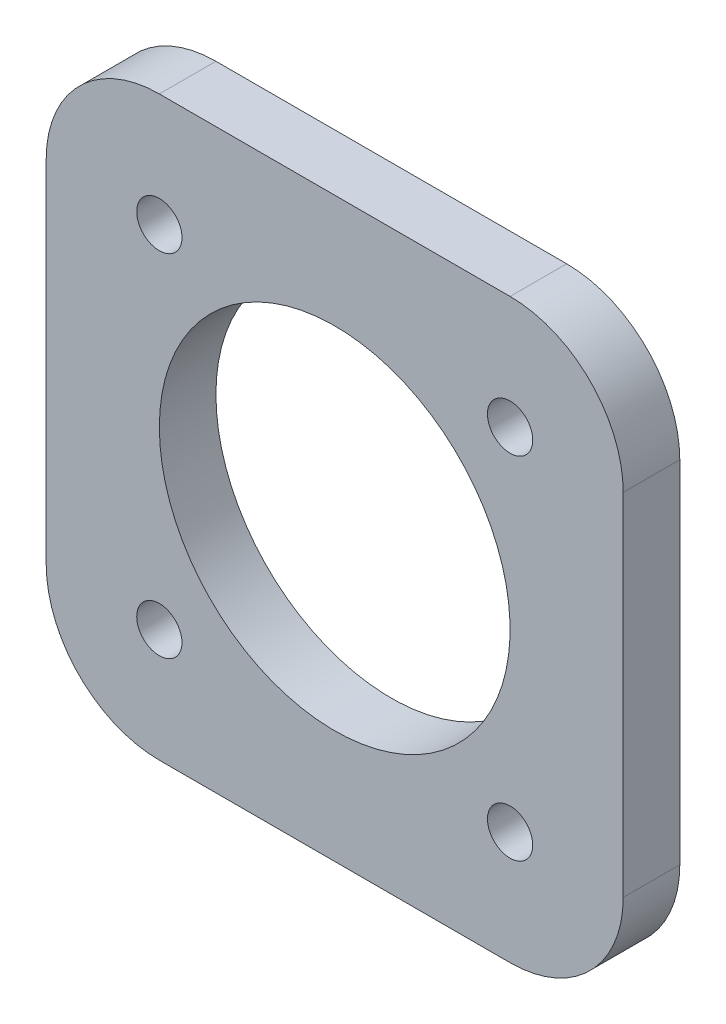
ISO-10303-21;
HEADER;
FILE_DESCRIPTION(('STEP AP214'),'2;1');
FILE_NAME('part.step','',(''),(''),'','','');
FILE_SCHEMA(('AUTOMOTIVE_DESIGN { 1 0 10303 214 1 1 1 1 }'));
ENDSEC;
DATA;
#1=APPLICATION_CONTEXT('core data for automotive mechanical design processes');
#2=APPLICATION_PROTOCOL_DEFINITION('international standard','automotive_design',2000,#1);
#3=PRODUCT_CONTEXT('',#1,'mechanical');
#4=PRODUCT('Part','Part','',(#3));
#5=PRODUCT_RELATED_PRODUCT_CATEGORY('part','',(#4));
#6=PRODUCT_DEFINITION_FORMATION('','',#4);
#7=PRODUCT_DEFINITION_CONTEXT('part definition',#1,'design');
#8=PRODUCT_DEFINITION('design','',#6,#7);
#9=PRODUCT_DEFINITION_SHAPE('','',#8);
#10=(LENGTH_UNIT() NAMED_UNIT(*) SI_UNIT(.MILLI.,.METRE.));
#11=(NAMED_UNIT(*) PLANE_ANGLE_UNIT() SI_UNIT($,.RADIAN.));
#12=(NAMED_UNIT(*) SI_UNIT($,.STERADIAN.) SOLID_ANGLE_UNIT());
#13=UNCERTAINTY_MEASURE_WITH_UNIT(LENGTH_MEASURE(1.E-05),#10,'distance_accuracy_value','');
#14=(GEOMETRIC_REPRESENTATION_CONTEXT(3) GLOBAL_UNCERTAINTY_ASSIGNED_CONTEXT((#13)) GLOBAL_UNIT_ASSIGNED_CONTEXT((#10,
#11,#12)) REPRESENTATION_CONTEXT('',''));
#15=CARTESIAN_POINT('',(0.,0.,0.));
#16=DIRECTION('',(0.,0.,1.));
#17=DIRECTION('',(1.,0.,0.));
#18=AXIS2_PLACEMENT_3D('',#15,#16,#17);
#19=CARTESIAN_POINT('',(15.5,15.5,5.));
#20=DIRECTION('',(0.,0.,-1.));
#21=DIRECTION('',(-1.,0.,0.));
#22=AXIS2_PLACEMENT_3D('',#19,#20,#21);
#23=PLANE('',#22);
#24=CARTESIAN_POINT('',(0.,0.,5.));
#25=DIRECTION('',(0.,0.,-1.));
#26=DIRECTION('',(-1.,0.,0.));
#27=AXIS2_PLACEMENT_3D('',#24,#25,#26);
#28=CIRCLE('',#27,15.5);
#29=CARTESIAN_POINT('',(-15.5,0.,5.));
#30=VERTEX_POINT('',#29);
#31=EDGE_CURVE('E206',#30,#30,#28,.F.);
#32=ORIENTED_EDGE('',*,*,#31,.F.);
#33=EDGE_LOOP('',(#32));
#34=FACE_BOUND('',#33,.T.);
#35=CARTESIAN_POINT('',(15.5,15.5,5.));
#36=DIRECTION('',(0.,0.,1.));
#37=DIRECTION('',(-1.,0.,0.));
#38=AXIS2_PLACEMENT_3D('',#35,#36,#37);
#39=CIRCLE('',#38,10.);
#40=CARTESIAN_POINT('',(25.5,15.4999999999999,5.));
#41=VERTEX_POINT('',#40);
#42=CARTESIAN_POINT('',(15.4999999999999,25.5,5.));
#43=VERTEX_POINT('',#42);
#44=EDGE_CURVE('E151',#41,#43,#39,.T.);
#45=ORIENTED_EDGE('',*,*,#44,.T.);
#46=DIRECTION('',(-1.,0.,0.));
#47=VECTOR('',#46,1.);
#48=CARTESIAN_POINT('',(-15.4999999999999,25.5,5.));
#49=LINE('',#48,#47);
#50=CARTESIAN_POINT('',(-15.4999999999999,25.5,5.));
#51=VERTEX_POINT('',#50);
#52=EDGE_CURVE('E99',#43,#51,#49,.T.);
#53=ORIENTED_EDGE('',*,*,#52,.T.);
#54=CARTESIAN_POINT('',(-15.5,15.5,5.));
#55=DIRECTION('',(0.,0.,1.));
#56=DIRECTION('',(-1.,0.,0.));
#57=AXIS2_PLACEMENT_3D('',#54,#55,#56);
#58=CIRCLE('',#57,10.);
#59=CARTESIAN_POINT('',(-25.5,15.4999999999999,5.));
#60=VERTEX_POINT('',#59);
#61=EDGE_CURVE('E166',#51,#60,#58,.T.);
#62=ORIENTED_EDGE('',*,*,#61,.T.);
#63=DIRECTION('',(0.,-1.,0.));
#64=VECTOR('',#63,1.);
#65=CARTESIAN_POINT('',(-25.5,-15.4999999999999,5.));
#66=LINE('',#65,#64);
#67=CARTESIAN_POINT('',(-25.5,-15.4999999999999,5.));
#68=VERTEX_POINT('',#67);
#69=EDGE_CURVE('E179',#60,#68,#66,.T.);
#70=ORIENTED_EDGE('',*,*,#69,.T.);
#71=CARTESIAN_POINT('',(-15.5,-15.5,5.));
#72=DIRECTION('',(0.,0.,1.));
#73=DIRECTION('',(-1.,0.,0.));
#74=AXIS2_PLACEMENT_3D('',#71,#72,#73);
#75=CIRCLE('',#74,10.);
#76=CARTESIAN_POINT('',(-15.4999999999999,-25.5,5.));
#77=VERTEX_POINT('',#76);
#78=EDGE_CURVE('E118',#68,#77,#75,.T.);
#79=ORIENTED_EDGE('',*,*,#78,.T.);
#80=DIRECTION('',(1.,0.,0.));
#81=VECTOR('',#80,1.);
#82=CARTESIAN_POINT('',(-15.4999999999999,-25.5,5.));
#83=LINE('',#82,#81);
#84=CARTESIAN_POINT('',(15.4999999999999,-25.5,5.));
#85=VERTEX_POINT('',#84);
#86=EDGE_CURVE('E112',#77,#85,#83,.T.);
#87=ORIENTED_EDGE('',*,*,#86,.T.);
#88=CARTESIAN_POINT('',(15.5,-15.5,5.));
#89=DIRECTION('',(0.,0.,1.));
#90=DIRECTION('',(1.,0.,0.));
#91=AXIS2_PLACEMENT_3D('',#88,#89,#90);
#92=CIRCLE('',#91,10.);
#93=CARTESIAN_POINT('',(25.5,-15.5,5.));
#94=VERTEX_POINT('',#93);
#95=EDGE_CURVE('E116',#85,#94,#92,.T.);
#96=ORIENTED_EDGE('',*,*,#95,.T.);
#97=DIRECTION('',(0.,1.,0.));
#98=VECTOR('',#97,1.);
#99=CARTESIAN_POINT('',(25.5,-15.4999999999999,5.));
#100=LINE('',#99,#98);
#101=EDGE_CURVE('E56',#94,#41,#100,.T.);
#102=ORIENTED_EDGE('',*,*,#101,.T.);
#103=EDGE_LOOP('',(#45,#53,#62,#70,#79,#87,#96,#102));
#104=FACE_BOUND('',#103,.T.);
#105=CARTESIAN_POINT('',(-15.5,15.5,5.));
#106=DIRECTION('',(0.,0.,1.));
#107=DIRECTION('',(1.,0.,0.));
#108=AXIS2_PLACEMENT_3D('',#105,#106,#107);
#109=CIRCLE('',#108,2.);
#110=CARTESIAN_POINT('',(-13.5,15.5,5.));
#111=VERTEX_POINT('',#110);
#112=EDGE_CURVE('E140',#111,#111,#109,.T.);
#113=ORIENTED_EDGE('',*,*,#112,.F.);
#114=EDGE_LOOP('',(#113));
#115=FACE_BOUND('',#114,.T.);
#116=CARTESIAN_POINT('',(15.5,15.5,5.));
#117=DIRECTION('',(0.,0.,1.));
#118=DIRECTION('',(-1.,0.,0.));
#119=AXIS2_PLACEMENT_3D('',#116,#117,#118);
#120=CIRCLE('',#119,2.);
#121=CARTESIAN_POINT('',(13.5,15.5,5.));
#122=VERTEX_POINT('',#121);
#123=EDGE_CURVE('E188',#122,#122,#120,.T.);
#124=ORIENTED_EDGE('',*,*,#123,.F.);
#125=EDGE_LOOP('',(#124));
#126=FACE_BOUND('',#125,.T.);
#127=CARTESIAN_POINT('',(15.5,-15.5,5.));
#128=DIRECTION('',(0.,0.,1.));
#129=DIRECTION('',(1.,0.,0.));
#130=AXIS2_PLACEMENT_3D('',#127,#128,#129);
#131=CIRCLE('',#130,2.);
#132=CARTESIAN_POINT('',(17.5,-15.5,5.));
#133=VERTEX_POINT('',#132);
#134=EDGE_CURVE('E194',#133,#133,#131,.T.);
#135=ORIENTED_EDGE('',*,*,#134,.F.);
#136=EDGE_LOOP('',(#135));
#137=FACE_BOUND('',#136,.T.);
#138=CARTESIAN_POINT('',(-15.5,-15.5,5.));
#139=DIRECTION('',(0.,0.,1.));
#140=DIRECTION('',(-1.,0.,0.));
#141=AXIS2_PLACEMENT_3D('',#138,#139,#140);
#142=CIRCLE('',#141,2.);
#143=CARTESIAN_POINT('',(-17.5,-15.5,5.));
#144=VERTEX_POINT('',#143);
#145=EDGE_CURVE('E200',#144,#144,#142,.T.);
#146=ORIENTED_EDGE('',*,*,#145,.F.);
#147=EDGE_LOOP('',(#146));
#148=FACE_BOUND('',#147,.T.);
#149=ADVANCED_FACE('F39',(#34,#104,#115,#126,#137,#148),#23,.F.);
#150=CARTESIAN_POINT('',(15.5,15.5,0.));
#151=DIRECTION('',(0.,0.,-1.));
#152=DIRECTION('',(-1.,0.,0.));
#153=AXIS2_PLACEMENT_3D('',#150,#151,#152);
#154=PLANE('',#153);
#155=CARTESIAN_POINT('',(0.,0.,0.));
#156=DIRECTION('',(0.,0.,1.));
#157=DIRECTION('',(1.,0.,0.));
#158=AXIS2_PLACEMENT_3D('',#155,#156,#157);
#159=CIRCLE('',#158,15.5);
#160=CARTESIAN_POINT('',(15.5,0.,0.));
#161=VERTEX_POINT('',#160);
#162=EDGE_CURVE('E211',#161,#161,#159,.T.);
#163=ORIENTED_EDGE('',*,*,#162,.T.);
#164=EDGE_LOOP('',(#163));
#165=FACE_BOUND('',#164,.T.);
#166=CARTESIAN_POINT('',(15.5,-15.5,0.));
#167=DIRECTION('',(0.,0.,1.));
#168=DIRECTION('',(1.,0.,0.));
#169=AXIS2_PLACEMENT_3D('',#166,#167,#168);
#170=CIRCLE('',#169,2.);
#171=CARTESIAN_POINT('',(17.5,-15.5,0.));
#172=VERTEX_POINT('',#171);
#173=EDGE_CURVE('E197',#172,#172,#170,.T.);
#174=ORIENTED_EDGE('',*,*,#173,.T.);
#175=EDGE_LOOP('',(#174));
#176=FACE_BOUND('',#175,.T.);
#177=CARTESIAN_POINT('',(-15.5,15.5,0.));
#178=DIRECTION('',(0.,0.,1.));
#179=DIRECTION('',(1.,0.,0.));
#180=AXIS2_PLACEMENT_3D('',#177,#178,#179);
#181=CIRCLE('',#180,2.);
#182=CARTESIAN_POINT('',(-13.5,15.5,0.));
#183=VERTEX_POINT('',#182);
#184=EDGE_CURVE('E185',#183,#183,#181,.T.);
#185=ORIENTED_EDGE('',*,*,#184,.T.);
#186=EDGE_LOOP('',(#185));
#187=FACE_BOUND('',#186,.T.);
#188=CARTESIAN_POINT('',(15.5,15.5,0.));
#189=DIRECTION('',(0.,0.,1.));
#190=DIRECTION('',(-1.,0.,0.));
#191=AXIS2_PLACEMENT_3D('',#188,#189,#190);
#192=CIRCLE('',#191,10.);
#193=CARTESIAN_POINT('',(25.5,15.4999999999999,0.));
#194=VERTEX_POINT('',#193);
#195=CARTESIAN_POINT('',(15.4999999999999,25.5,0.));
#196=VERTEX_POINT('',#195);
#197=EDGE_CURVE('E136',#194,#196,#192,.T.);
#198=ORIENTED_EDGE('',*,*,#197,.F.);
#199=DIRECTION('',(0.,1.,0.));
#200=VECTOR('',#199,1.);
#201=CARTESIAN_POINT('',(25.5,-15.4999999999999,0.));
#202=LINE('',#201,#200);
#203=CARTESIAN_POINT('',(25.5,-15.5,0.));
#204=VERTEX_POINT('',#203);
#205=EDGE_CURVE('E91',#204,#194,#202,.T.);
#206=ORIENTED_EDGE('',*,*,#205,.F.);
#207=CARTESIAN_POINT('',(15.5,-15.5,0.));
#208=DIRECTION('',(0.,0.,1.));
#209=DIRECTION('',(1.,0.,0.));
#210=AXIS2_PLACEMENT_3D('',#207,#208,#209);
#211=CIRCLE('',#210,10.);
#212=CARTESIAN_POINT('',(15.4999999999999,-25.5,0.));
#213=VERTEX_POINT('',#212);
#214=EDGE_CURVE('E85',#213,#204,#211,.T.);
#215=ORIENTED_EDGE('',*,*,#214,.F.);
#216=DIRECTION('',(1.,0.,0.));
#217=VECTOR('',#216,1.);
#218=CARTESIAN_POINT('',(-15.4999999999999,-25.5,0.));
#219=LINE('',#218,#217);
#220=CARTESIAN_POINT('',(-15.4999999999999,-25.5,0.));
#221=VERTEX_POINT('',#220);
#222=EDGE_CURVE('E126',#221,#213,#219,.T.);
#223=ORIENTED_EDGE('',*,*,#222,.F.);
#224=CARTESIAN_POINT('',(-15.5,-15.5,0.));
#225=DIRECTION('',(0.,0.,1.));
#226=DIRECTION('',(-1.,0.,0.));
#227=AXIS2_PLACEMENT_3D('',#224,#225,#226);
#228=CIRCLE('',#227,10.);
#229=CARTESIAN_POINT('',(-25.5,-15.4999999999999,0.));
#230=VERTEX_POINT('',#229);
#231=EDGE_CURVE('E146',#230,#221,#228,.T.);
#232=ORIENTED_EDGE('',*,*,#231,.F.);
#233=DIRECTION('',(0.,-1.,0.));
#234=VECTOR('',#233,1.);
#235=CARTESIAN_POINT('',(-25.5,-15.4999999999999,0.));
#236=LINE('',#235,#234);
#237=CARTESIAN_POINT('',(-25.5,15.4999999999999,0.));
#238=VERTEX_POINT('',#237);
#239=EDGE_CURVE('E144',#238,#230,#236,.T.);
#240=ORIENTED_EDGE('',*,*,#239,.F.);
#241=CARTESIAN_POINT('',(-15.5,15.5,0.));
#242=DIRECTION('',(0.,0.,1.));
#243=DIRECTION('',(-1.,0.,0.));
#244=AXIS2_PLACEMENT_3D('',#241,#242,#243);
#245=CIRCLE('',#244,10.);
#246=CARTESIAN_POINT('',(-15.4999999999999,25.5,0.));
#247=VERTEX_POINT('',#246);
#248=EDGE_CURVE('E142',#247,#238,#245,.T.);
#249=ORIENTED_EDGE('',*,*,#248,.F.);
#250=DIRECTION('',(-1.,0.,0.));
#251=VECTOR('',#250,1.);
#252=CARTESIAN_POINT('',(-15.4999999999999,25.5,0.));
#253=LINE('',#252,#251);
#254=EDGE_CURVE('E139',#196,#247,#253,.T.);
#255=ORIENTED_EDGE('',*,*,#254,.F.);
#256=EDGE_LOOP('',(#198,#206,#215,#223,#232,#240,#249,#255));
#257=FACE_BOUND('',#256,.T.);
#258=CARTESIAN_POINT('',(15.5,15.5,0.));
#259=DIRECTION('',(0.,0.,1.));
#260=DIRECTION('',(-1.,0.,0.));
#261=AXIS2_PLACEMENT_3D('',#258,#259,#260);
#262=CIRCLE('',#261,2.);
#263=CARTESIAN_POINT('',(13.5,15.5,0.));
#264=VERTEX_POINT('',#263);
#265=EDGE_CURVE('E191',#264,#264,#262,.T.);
#266=ORIENTED_EDGE('',*,*,#265,.T.);
#267=EDGE_LOOP('',(#266));
#268=FACE_BOUND('',#267,.T.);
#269=CARTESIAN_POINT('',(-15.5,-15.5,0.));
#270=DIRECTION('',(0.,0.,1.));
#271=DIRECTION('',(-1.,0.,0.));
#272=AXIS2_PLACEMENT_3D('',#269,#270,#271);
#273=CIRCLE('',#272,2.);
#274=CARTESIAN_POINT('',(-17.5,-15.5,0.));
#275=VERTEX_POINT('',#274);
#276=EDGE_CURVE('E203',#275,#275,#273,.T.);
#277=ORIENTED_EDGE('',*,*,#276,.T.);
#278=EDGE_LOOP('',(#277));
#279=FACE_BOUND('',#278,.T.);
#280=ADVANCED_FACE('F170',(#165,#176,#187,#257,#268,#279),#154,.T.);
#281=CARTESIAN_POINT('',(15.5,15.5,5.));
#282=DIRECTION('',(0.,0.,-1.));
#283=DIRECTION('',(-1.,0.,0.));
#284=AXIS2_PLACEMENT_3D('',#281,#282,#283);
#285=CYLINDRICAL_SURFACE('',#284,10.);
#286=ORIENTED_EDGE('',*,*,#197,.T.);
#287=DIRECTION('',(0.,0.,-1.));
#288=VECTOR('',#287,1.);
#289=CARTESIAN_POINT('',(15.4999999999999,25.5,5.));
#290=LINE('',#289,#288);
#291=EDGE_CURVE('E11',#43,#196,#290,.T.);
#292=ORIENTED_EDGE('',*,*,#291,.F.);
#293=ORIENTED_EDGE('',*,*,#44,.F.);
#294=DIRECTION('',(0.,0.,-1.));
#295=VECTOR('',#294,1.);
#296=CARTESIAN_POINT('',(25.5,15.4999999999999,5.));
#297=LINE('',#296,#295);
#298=EDGE_CURVE('E132',#41,#194,#297,.T.);
#299=ORIENTED_EDGE('',*,*,#298,.T.);
#300=EDGE_LOOP('',(#286,#292,#293,#299));
#301=FACE_BOUND('',#300,.T.);
#302=ADVANCED_FACE('F41',(#301),#285,.T.);
#303=CARTESIAN_POINT('',(-15.4999999999999,25.5,5.));
#304=DIRECTION('',(0.,-1.,0.));
#305=DIRECTION('',(0.,0.,-1.));
#306=AXIS2_PLACEMENT_3D('',#303,#304,#305);
#307=PLANE('',#306);
#308=ORIENTED_EDGE('',*,*,#254,.T.);
#309=DIRECTION('',(0.,0.,-1.));
#310=VECTOR('',#309,1.);
#311=CARTESIAN_POINT('',(-15.4999999999999,25.5,5.));
#312=LINE('',#311,#310);
#313=EDGE_CURVE('E48',#51,#247,#312,.T.);
#314=ORIENTED_EDGE('',*,*,#313,.F.);
#315=ORIENTED_EDGE('',*,*,#52,.F.);
#316=ORIENTED_EDGE('',*,*,#291,.T.);
#317=EDGE_LOOP('',(#308,#314,#315,#316));
#318=FACE_BOUND('',#317,.T.);
#319=ADVANCED_FACE('F246',(#318),#307,.F.);
#320=CARTESIAN_POINT('',(-15.5,15.5,5.));
#321=DIRECTION('',(0.,0.,-1.));
#322=DIRECTION('',(-1.,0.,0.));
#323=AXIS2_PLACEMENT_3D('',#320,#321,#322);
#324=CYLINDRICAL_SURFACE('',#323,10.);
#325=ORIENTED_EDGE('',*,*,#248,.T.);
#326=DIRECTION('',(0.,0.,-1.));
#327=VECTOR('',#326,1.);
#328=CARTESIAN_POINT('',(-25.5,15.4999999999999,5.));
#329=LINE('',#328,#327);
#330=EDGE_CURVE('E158',#60,#238,#329,.T.);
#331=ORIENTED_EDGE('',*,*,#330,.F.);
#332=ORIENTED_EDGE('',*,*,#61,.F.);
#333=ORIENTED_EDGE('',*,*,#313,.T.);
#334=EDGE_LOOP('',(#325,#331,#332,#333));
#335=FACE_BOUND('',#334,.T.);
#336=ADVANCED_FACE('F164',(#335),#324,.T.);
#337=CARTESIAN_POINT('',(-25.5,-15.4999999999999,5.));
#338=DIRECTION('',(1.,0.,0.));
#339=DIRECTION('',(0.,0.,-1.));
#340=AXIS2_PLACEMENT_3D('',#337,#338,#339);
#341=PLANE('',#340);
#342=ORIENTED_EDGE('',*,*,#239,.T.);
#343=DIRECTION('',(0.,0.,-1.));
#344=VECTOR('',#343,1.);
#345=CARTESIAN_POINT('',(-25.5,-15.4999999999999,5.));
#346=LINE('',#345,#344);
#347=EDGE_CURVE('E155',#68,#230,#346,.T.);
#348=ORIENTED_EDGE('',*,*,#347,.F.);
#349=ORIENTED_EDGE('',*,*,#69,.F.);
#350=ORIENTED_EDGE('',*,*,#330,.T.);
#351=EDGE_LOOP('',(#342,#348,#349,#350));
#352=FACE_BOUND('',#351,.T.);
#353=ADVANCED_FACE('F175',(#352),#341,.F.);
#354=CARTESIAN_POINT('',(-15.5,-15.5,5.));
#355=DIRECTION('',(0.,0.,-1.));
#356=DIRECTION('',(-1.,0.,0.));
#357=AXIS2_PLACEMENT_3D('',#354,#355,#356);
#358=CYLINDRICAL_SURFACE('',#357,10.);
#359=ORIENTED_EDGE('',*,*,#231,.T.);
#360=DIRECTION('',(0.,0.,-1.));
#361=VECTOR('',#360,1.);
#362=CARTESIAN_POINT('',(-15.4999999999999,-25.5,5.));
#363=LINE('',#362,#361);
#364=EDGE_CURVE('E127',#77,#221,#363,.T.);
#365=ORIENTED_EDGE('',*,*,#364,.F.);
#366=ORIENTED_EDGE('',*,*,#78,.F.);
#367=ORIENTED_EDGE('',*,*,#347,.T.);
#368=EDGE_LOOP('',(#359,#365,#366,#367));
#369=FACE_BOUND('',#368,.T.);
#370=ADVANCED_FACE('F178',(#369),#358,.T.);
#371=CARTESIAN_POINT('',(-15.4999999999999,-25.5,5.));
#372=DIRECTION('',(0.,1.,0.));
#373=DIRECTION('',(0.,0.,1.));
#374=AXIS2_PLACEMENT_3D('',#371,#372,#373);
#375=PLANE('',#374);
#376=ORIENTED_EDGE('',*,*,#222,.T.);
#377=DIRECTION('',(0.,0.,-1.));
#378=VECTOR('',#377,1.);
#379=CARTESIAN_POINT('',(15.4999999999999,-25.5,5.));
#380=LINE('',#379,#378);
#381=EDGE_CURVE('E123',#85,#213,#380,.T.);
#382=ORIENTED_EDGE('',*,*,#381,.F.);
#383=ORIENTED_EDGE('',*,*,#86,.F.);
#384=ORIENTED_EDGE('',*,*,#364,.T.);
#385=EDGE_LOOP('',(#376,#382,#383,#384));
#386=FACE_BOUND('',#385,.T.);
#387=ADVANCED_FACE('F124',(#386),#375,.F.);
#388=CARTESIAN_POINT('',(15.5,-15.5,5.));
#389=DIRECTION('',(0.,0.,-1.));
#390=DIRECTION('',(-1.,0.,0.));
#391=AXIS2_PLACEMENT_3D('',#388,#389,#390);
#392=CYLINDRICAL_SURFACE('',#391,10.);
#393=ORIENTED_EDGE('',*,*,#214,.T.);
#394=DIRECTION('',(0.,0.,-1.));
#395=VECTOR('',#394,1.);
#396=CARTESIAN_POINT('',(25.5,-15.5,5.));
#397=LINE('',#396,#395);
#398=EDGE_CURVE('E128',#94,#204,#397,.T.);
#399=ORIENTED_EDGE('',*,*,#398,.F.);
#400=ORIENTED_EDGE('',*,*,#95,.F.);
#401=ORIENTED_EDGE('',*,*,#381,.T.);
#402=EDGE_LOOP('',(#393,#399,#400,#401));
#403=FACE_BOUND('',#402,.T.);
#404=ADVANCED_FACE('F130',(#403),#392,.T.);
#405=CARTESIAN_POINT('',(25.5,-15.4999999999999,5.));
#406=DIRECTION('',(-1.,0.,0.));
#407=DIRECTION('',(0.,0.,1.));
#408=AXIS2_PLACEMENT_3D('',#405,#406,#407);
#409=PLANE('',#408);
#410=ORIENTED_EDGE('',*,*,#205,.T.);
#411=ORIENTED_EDGE('',*,*,#298,.F.);
#412=ORIENTED_EDGE('',*,*,#101,.F.);
#413=ORIENTED_EDGE('',*,*,#398,.T.);
#414=EDGE_LOOP('',(#410,#411,#412,#413));
#415=FACE_BOUND('',#414,.T.);
#416=ADVANCED_FACE('F234',(#415),#409,.F.);
#417=CARTESIAN_POINT('',(-15.5,15.5,5.));
#418=DIRECTION('',(0.,0.,-1.));
#419=DIRECTION('',(-1.,0.,0.));
#420=AXIS2_PLACEMENT_3D('',#417,#418,#419);
#421=CYLINDRICAL_SURFACE('',#420,2.);
#422=ORIENTED_EDGE('',*,*,#112,.T.);
#423=EDGE_LOOP('',(#422));
#424=FACE_BOUND('',#423,.T.);
#425=ORIENTED_EDGE('',*,*,#184,.F.);
#426=EDGE_LOOP('',(#425));
#427=FACE_BOUND('',#426,.T.);
#428=ADVANCED_FACE('F231',(#424,#427),#421,.F.);
#429=CARTESIAN_POINT('',(15.5,15.5,5.));
#430=DIRECTION('',(0.,0.,-1.));
#431=DIRECTION('',(-1.,0.,0.));
#432=AXIS2_PLACEMENT_3D('',#429,#430,#431);
#433=CYLINDRICAL_SURFACE('',#432,2.);
#434=ORIENTED_EDGE('',*,*,#123,.T.);
#435=EDGE_LOOP('',(#434));
#436=FACE_BOUND('',#435,.T.);
#437=ORIENTED_EDGE('',*,*,#265,.F.);
#438=EDGE_LOOP('',(#437));
#439=FACE_BOUND('',#438,.T.);
#440=ADVANCED_FACE('F284',(#436,#439),#433,.F.);
#441=CARTESIAN_POINT('',(15.5,-15.5,5.));
#442=DIRECTION('',(0.,0.,-1.));
#443=DIRECTION('',(-1.,0.,0.));
#444=AXIS2_PLACEMENT_3D('',#441,#442,#443);
#445=CYLINDRICAL_SURFACE('',#444,2.);
#446=ORIENTED_EDGE('',*,*,#134,.T.);
#447=EDGE_LOOP('',(#446));
#448=FACE_BOUND('',#447,.T.);
#449=ORIENTED_EDGE('',*,*,#173,.F.);
#450=EDGE_LOOP('',(#449));
#451=FACE_BOUND('',#450,.T.);
#452=ADVANCED_FACE('F277',(#448,#451),#445,.F.);
#453=CARTESIAN_POINT('',(-15.5,-15.5,5.));
#454=DIRECTION('',(0.,0.,-1.));
#455=DIRECTION('',(-1.,0.,0.));
#456=AXIS2_PLACEMENT_3D('',#453,#454,#455);
#457=CYLINDRICAL_SURFACE('',#456,2.);
#458=ORIENTED_EDGE('',*,*,#145,.T.);
#459=EDGE_LOOP('',(#458));
#460=FACE_BOUND('',#459,.T.);
#461=ORIENTED_EDGE('',*,*,#276,.F.);
#462=EDGE_LOOP('',(#461));
#463=FACE_BOUND('',#462,.T.);
#464=ADVANCED_FACE('F220',(#460,#463),#457,.F.);
#465=CARTESIAN_POINT('',(0.,0.,30.));
#466=DIRECTION('',(0.,0.,-1.));
#467=DIRECTION('',(-1.,0.,0.));
#468=AXIS2_PLACEMENT_3D('',#465,#466,#467);
#469=CYLINDRICAL_SURFACE('',#468,15.5);
#470=ORIENTED_EDGE('',*,*,#162,.F.);
#471=EDGE_LOOP('',(#470));
#472=FACE_BOUND('',#471,.T.);
#473=ORIENTED_EDGE('',*,*,#31,.T.);
#474=EDGE_LOOP('',(#473));
#475=FACE_BOUND('',#474,.T.);
#476=ADVANCED_FACE('F217',(#472,#475),#469,.F.);
#477=CLOSED_SHELL('',(#149,#280,#302,#319,#336,#353,#370,#387,#404,#416,#428,#440,#452,#464,#476));
#478=MANIFOLD_SOLID_BREP('B2',#477);
#479=ADVANCED_BREP_SHAPE_REPRESENTATION('',(#18,#478),#14);
#480=SHAPE_DEFINITION_REPRESENTATION(#9,#479);
ENDSEC;
END-ISO-10303-21;
